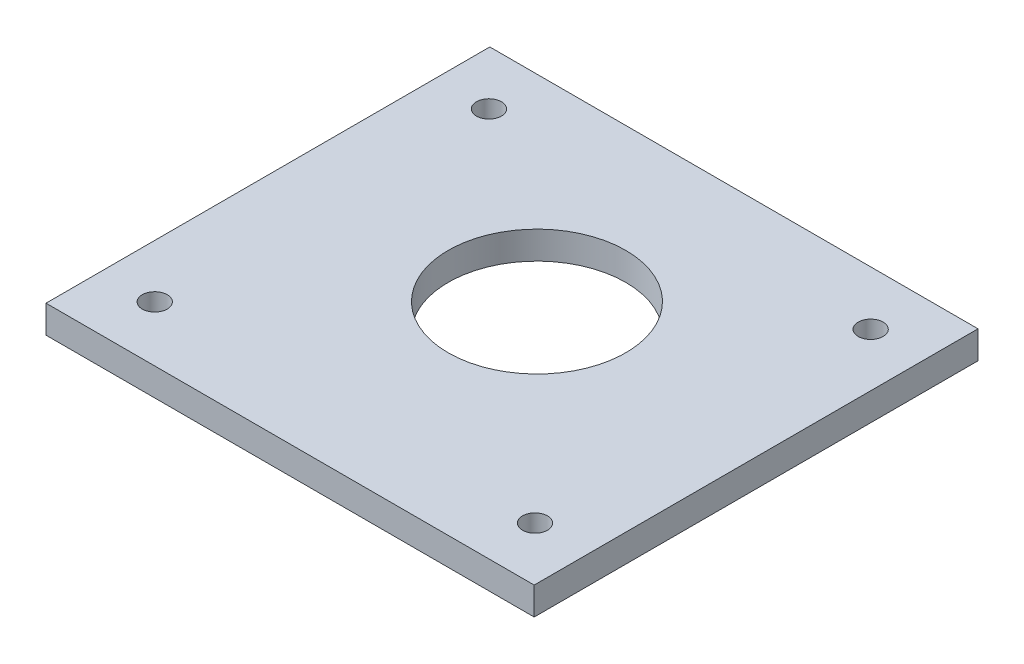
ISO-10303-21;
HEADER;
FILE_DESCRIPTION(('STEP AP214'),'2;1');
FILE_NAME('part.step','',(''),(''),'','','');
FILE_SCHEMA(('AUTOMOTIVE_DESIGN { 1 0 10303 214 1 1 1 1 }'));
ENDSEC;
DATA;
#1=APPLICATION_CONTEXT('core data for automotive mechanical design processes');
#2=APPLICATION_PROTOCOL_DEFINITION('international standard','automotive_design',2000,#1);
#3=PRODUCT_CONTEXT('',#1,'mechanical');
#4=PRODUCT('Part','Part','',(#3));
#5=PRODUCT_RELATED_PRODUCT_CATEGORY('part','',(#4));
#6=PRODUCT_DEFINITION_FORMATION('','',#4);
#7=PRODUCT_DEFINITION_CONTEXT('part definition',#1,'design');
#8=PRODUCT_DEFINITION('design','',#6,#7);
#9=PRODUCT_DEFINITION_SHAPE('','',#8);
#10=(LENGTH_UNIT() NAMED_UNIT(*) SI_UNIT(.MILLI.,.METRE.));
#11=(NAMED_UNIT(*) PLANE_ANGLE_UNIT() SI_UNIT($,.RADIAN.));
#12=(NAMED_UNIT(*) SI_UNIT($,.STERADIAN.) SOLID_ANGLE_UNIT());
#13=UNCERTAINTY_MEASURE_WITH_UNIT(LENGTH_MEASURE(1.E-05),#10,'distance_accuracy_value','');
#14=(GEOMETRIC_REPRESENTATION_CONTEXT(3) GLOBAL_UNCERTAINTY_ASSIGNED_CONTEXT((#13)) GLOBAL_UNIT_ASSIGNED_CONTEXT((#10,
#11,#12)) REPRESENTATION_CONTEXT('',''));
#15=CARTESIAN_POINT('',(0.,0.,0.));
#16=DIRECTION('',(0.,0.,1.));
#17=DIRECTION('',(1.,0.,0.));
#18=AXIS2_PLACEMENT_3D('',#15,#16,#17);
#19=CARTESIAN_POINT('',(0.,5.,0.));
#20=DIRECTION('',(0.,1.,0.));
#21=DIRECTION('',(0.,0.,1.));
#22=AXIS2_PLACEMENT_3D('',#19,#20,#21);
#23=PLANE('',#22);
#24=CARTESIAN_POINT('',(-34.4,5.,30.));
#25=DIRECTION('',(0.,1.,0.));
#26=DIRECTION('',(0.,0.,1.));
#27=AXIS2_PLACEMENT_3D('',#24,#25,#26);
#28=CIRCLE('',#27,2.25);
#29=CARTESIAN_POINT('',(-34.4,5.,32.25));
#30=VERTEX_POINT('',#29);
#31=EDGE_CURVE('E155',#30,#30,#28,.T.);
#32=ORIENTED_EDGE('',*,*,#31,.F.);
#33=EDGE_LOOP('',(#32));
#34=FACE_BOUND('',#33,.T.);
#35=CARTESIAN_POINT('',(34.4,5.,-30.25));
#36=DIRECTION('',(0.,1.,0.));
#37=DIRECTION('',(0.,0.,1.));
#38=AXIS2_PLACEMENT_3D('',#35,#36,#37);
#39=CIRCLE('',#38,2.25);
#40=CARTESIAN_POINT('',(34.4,5.,-28.));
#41=VERTEX_POINT('',#40);
#42=EDGE_CURVE('E139',#41,#41,#39,.T.);
#43=ORIENTED_EDGE('',*,*,#42,.F.);
#44=EDGE_LOOP('',(#43));
#45=FACE_BOUND('',#44,.T.);
#46=DIRECTION('',(0.,0.,-1.));
#47=VECTOR('',#46,1.);
#48=CARTESIAN_POINT('',(44.,5.,-40.));
#49=LINE('',#48,#47);
#50=CARTESIAN_POINT('',(44.,5.,40.));
#51=VERTEX_POINT('',#50);
#52=CARTESIAN_POINT('',(44.,5.,-40.));
#53=VERTEX_POINT('',#52);
#54=EDGE_CURVE('E94',#51,#53,#49,.T.);
#55=ORIENTED_EDGE('',*,*,#54,.T.);
#56=DIRECTION('',(-1.,0.,0.));
#57=VECTOR('',#56,1.);
#58=CARTESIAN_POINT('',(-44.,5.,-40.));
#59=LINE('',#58,#57);
#60=CARTESIAN_POINT('',(-44.,5.,-40.));
#61=VERTEX_POINT('',#60);
#62=EDGE_CURVE('E89',#53,#61,#59,.T.);
#63=ORIENTED_EDGE('',*,*,#62,.T.);
#64=DIRECTION('',(0.,0.,1.));
#65=VECTOR('',#64,1.);
#66=CARTESIAN_POINT('',(-44.,5.,-40.));
#67=LINE('',#66,#65);
#68=CARTESIAN_POINT('',(-44.,5.,40.));
#69=VERTEX_POINT('',#68);
#70=EDGE_CURVE('E92',#61,#69,#67,.T.);
#71=ORIENTED_EDGE('',*,*,#70,.T.);
#72=DIRECTION('',(1.,0.,0.));
#73=VECTOR('',#72,1.);
#74=CARTESIAN_POINT('',(-44.,5.,40.));
#75=LINE('',#74,#73);
#76=EDGE_CURVE('E59',#69,#51,#75,.T.);
#77=ORIENTED_EDGE('',*,*,#76,.T.);
#78=EDGE_LOOP('',(#55,#63,#71,#77));
#79=FACE_BOUND('',#78,.T.);
#80=CARTESIAN_POINT('',(-34.4,5.,-30.25));
#81=DIRECTION('',(0.,1.,0.));
#82=DIRECTION('',(0.,0.,1.));
#83=AXIS2_PLACEMENT_3D('',#80,#81,#82);
#84=CIRCLE('',#83,2.25);
#85=CARTESIAN_POINT('',(-34.4,5.,-28.));
#86=VERTEX_POINT('',#85);
#87=EDGE_CURVE('E115',#86,#86,#84,.T.);
#88=ORIENTED_EDGE('',*,*,#87,.F.);
#89=EDGE_LOOP('',(#88));
#90=FACE_BOUND('',#89,.T.);
#91=CARTESIAN_POINT('',(34.4,5.,30.25));
#92=DIRECTION('',(0.,1.,0.));
#93=DIRECTION('',(0.,0.,1.));
#94=AXIS2_PLACEMENT_3D('',#91,#92,#93);
#95=CIRCLE('',#94,2.25);
#96=CARTESIAN_POINT('',(34.4,5.,32.5));
#97=VERTEX_POINT('',#96);
#98=EDGE_CURVE('E147',#97,#97,#95,.T.);
#99=ORIENTED_EDGE('',*,*,#98,.F.);
#100=EDGE_LOOP('',(#99));
#101=FACE_BOUND('',#100,.T.);
#102=CARTESIAN_POINT('',(0.,5.,-4.5));
#103=DIRECTION('',(0.,1.,0.));
#104=DIRECTION('',(0.,0.,1.));
#105=AXIS2_PLACEMENT_3D('',#102,#103,#104);
#106=CIRCLE('',#105,16.);
#107=CARTESIAN_POINT('',(0.,5.,11.5));
#108=VERTEX_POINT('',#107);
#109=EDGE_CURVE('E163',#108,#108,#106,.T.);
#110=ORIENTED_EDGE('',*,*,#109,.F.);
#111=EDGE_LOOP('',(#110));
#112=FACE_BOUND('',#111,.T.);
#113=ADVANCED_FACE('F41',(#34,#45,#79,#90,#101,#112),#23,.T.);
#114=CARTESIAN_POINT('',(0.,0.,0.));
#115=DIRECTION('',(0.,1.,0.));
#116=DIRECTION('',(0.,0.,1.));
#117=AXIS2_PLACEMENT_3D('',#114,#115,#116);
#118=PLANE('',#117);
#119=DIRECTION('',(0.,0.,-1.));
#120=VECTOR('',#119,1.);
#121=CARTESIAN_POINT('',(44.,0.,-40.));
#122=LINE('',#121,#120);
#123=CARTESIAN_POINT('',(44.,0.,40.));
#124=VERTEX_POINT('',#123);
#125=CARTESIAN_POINT('',(44.,0.,-40.));
#126=VERTEX_POINT('',#125);
#127=EDGE_CURVE('E111',#124,#126,#122,.T.);
#128=ORIENTED_EDGE('',*,*,#127,.F.);
#129=DIRECTION('',(1.,0.,0.));
#130=VECTOR('',#129,1.);
#131=CARTESIAN_POINT('',(-44.,0.,40.));
#132=LINE('',#131,#130);
#133=CARTESIAN_POINT('',(-44.,0.,40.));
#134=VERTEX_POINT('',#133);
#135=EDGE_CURVE('E82',#134,#124,#132,.T.);
#136=ORIENTED_EDGE('',*,*,#135,.F.);
#137=DIRECTION('',(0.,0.,1.));
#138=VECTOR('',#137,1.);
#139=CARTESIAN_POINT('',(-44.,0.,-40.));
#140=LINE('',#139,#138);
#141=CARTESIAN_POINT('',(-44.,0.,-40.));
#142=VERTEX_POINT('',#141);
#143=EDGE_CURVE('E76',#142,#134,#140,.T.);
#144=ORIENTED_EDGE('',*,*,#143,.F.);
#145=DIRECTION('',(-1.,0.,0.));
#146=VECTOR('',#145,1.);
#147=CARTESIAN_POINT('',(-44.,0.,-40.));
#148=LINE('',#147,#146);
#149=EDGE_CURVE('E99',#126,#142,#148,.T.);
#150=ORIENTED_EDGE('',*,*,#149,.F.);
#151=EDGE_LOOP('',(#128,#136,#144,#150));
#152=FACE_BOUND('',#151,.T.);
#153=CARTESIAN_POINT('',(-34.4,0.,-30.25));
#154=DIRECTION('',(0.,1.,0.));
#155=DIRECTION('',(0.,0.,1.));
#156=AXIS2_PLACEMENT_3D('',#153,#154,#155);
#157=CIRCLE('',#156,2.25);
#158=CARTESIAN_POINT('',(-34.4,0.,-28.));
#159=VERTEX_POINT('',#158);
#160=EDGE_CURVE('E135',#159,#159,#157,.T.);
#161=ORIENTED_EDGE('',*,*,#160,.T.);
#162=EDGE_LOOP('',(#161));
#163=FACE_BOUND('',#162,.T.);
#164=CARTESIAN_POINT('',(34.4,0.,-30.25));
#165=DIRECTION('',(0.,1.,0.));
#166=DIRECTION('',(0.,0.,1.));
#167=AXIS2_PLACEMENT_3D('',#164,#165,#166);
#168=CIRCLE('',#167,2.25);
#169=CARTESIAN_POINT('',(34.4,0.,-28.));
#170=VERTEX_POINT('',#169);
#171=EDGE_CURVE('E143',#170,#170,#168,.T.);
#172=ORIENTED_EDGE('',*,*,#171,.T.);
#173=EDGE_LOOP('',(#172));
#174=FACE_BOUND('',#173,.T.);
#175=CARTESIAN_POINT('',(34.4,0.,30.25));
#176=DIRECTION('',(0.,1.,0.));
#177=DIRECTION('',(0.,0.,1.));
#178=AXIS2_PLACEMENT_3D('',#175,#176,#177);
#179=CIRCLE('',#178,2.25);
#180=CARTESIAN_POINT('',(34.4,0.,32.5));
#181=VERTEX_POINT('',#180);
#182=EDGE_CURVE('E151',#181,#181,#179,.T.);
#183=ORIENTED_EDGE('',*,*,#182,.T.);
#184=EDGE_LOOP('',(#183));
#185=FACE_BOUND('',#184,.T.);
#186=CARTESIAN_POINT('',(-34.4,0.,30.));
#187=DIRECTION('',(0.,1.,0.));
#188=DIRECTION('',(0.,0.,1.));
#189=AXIS2_PLACEMENT_3D('',#186,#187,#188);
#190=CIRCLE('',#189,2.25);
#191=CARTESIAN_POINT('',(-34.4,0.,32.25));
#192=VERTEX_POINT('',#191);
#193=EDGE_CURVE('E159',#192,#192,#190,.T.);
#194=ORIENTED_EDGE('',*,*,#193,.T.);
#195=EDGE_LOOP('',(#194));
#196=FACE_BOUND('',#195,.T.);
#197=CARTESIAN_POINT('',(0.,0.,-4.5));
#198=DIRECTION('',(0.,1.,0.));
#199=DIRECTION('',(0.,0.,1.));
#200=AXIS2_PLACEMENT_3D('',#197,#198,#199);
#201=CIRCLE('',#200,16.);
#202=CARTESIAN_POINT('',(0.,0.,11.5));
#203=VERTEX_POINT('',#202);
#204=EDGE_CURVE('E167',#203,#203,#201,.T.);
#205=ORIENTED_EDGE('',*,*,#204,.T.);
#206=EDGE_LOOP('',(#205));
#207=FACE_BOUND('',#206,.T.);
#208=ADVANCED_FACE('F129',(#152,#163,#174,#185,#196,#207),#118,.F.);
#209=CARTESIAN_POINT('',(44.,5.,-40.));
#210=DIRECTION('',(-1.,0.,0.));
#211=DIRECTION('',(0.,0.,1.));
#212=AXIS2_PLACEMENT_3D('',#209,#210,#211);
#213=PLANE('',#212);
#214=ORIENTED_EDGE('',*,*,#127,.T.);
#215=DIRECTION('',(0.,-1.,0.));
#216=VECTOR('',#215,1.);
#217=CARTESIAN_POINT('',(44.,5.,-40.));
#218=LINE('',#217,#216);
#219=EDGE_CURVE('E11',#53,#126,#218,.T.);
#220=ORIENTED_EDGE('',*,*,#219,.F.);
#221=ORIENTED_EDGE('',*,*,#54,.F.);
#222=DIRECTION('',(0.,-1.,0.));
#223=VECTOR('',#222,1.);
#224=CARTESIAN_POINT('',(44.,5.,40.));
#225=LINE('',#224,#223);
#226=EDGE_CURVE('E107',#51,#124,#225,.T.);
#227=ORIENTED_EDGE('',*,*,#226,.T.);
#228=EDGE_LOOP('',(#214,#220,#221,#227));
#229=FACE_BOUND('',#228,.T.);
#230=ADVANCED_FACE('F43',(#229),#213,.F.);
#231=CARTESIAN_POINT('',(-44.,5.,-40.));
#232=DIRECTION('',(0.,0.,1.));
#233=DIRECTION('',(1.,0.,0.));
#234=AXIS2_PLACEMENT_3D('',#231,#232,#233);
#235=PLANE('',#234);
#236=ORIENTED_EDGE('',*,*,#149,.T.);
#237=DIRECTION('',(0.,-1.,0.));
#238=VECTOR('',#237,1.);
#239=CARTESIAN_POINT('',(-44.,5.,-40.));
#240=LINE('',#239,#238);
#241=EDGE_CURVE('E51',#61,#142,#240,.T.);
#242=ORIENTED_EDGE('',*,*,#241,.F.);
#243=ORIENTED_EDGE('',*,*,#62,.F.);
#244=ORIENTED_EDGE('',*,*,#219,.T.);
#245=EDGE_LOOP('',(#236,#242,#243,#244));
#246=FACE_BOUND('',#245,.T.);
#247=ADVANCED_FACE('F98',(#246),#235,.F.);
#248=CARTESIAN_POINT('',(-44.,5.,-40.));
#249=DIRECTION('',(1.,0.,0.));
#250=DIRECTION('',(0.,0.,-1.));
#251=AXIS2_PLACEMENT_3D('',#248,#249,#250);
#252=PLANE('',#251);
#253=ORIENTED_EDGE('',*,*,#143,.T.);
#254=DIRECTION('',(0.,-1.,0.));
#255=VECTOR('',#254,1.);
#256=CARTESIAN_POINT('',(-44.,5.,40.));
#257=LINE('',#256,#255);
#258=EDGE_CURVE('E101',#69,#134,#257,.T.);
#259=ORIENTED_EDGE('',*,*,#258,.F.);
#260=ORIENTED_EDGE('',*,*,#70,.F.);
#261=ORIENTED_EDGE('',*,*,#241,.T.);
#262=EDGE_LOOP('',(#253,#259,#260,#261));
#263=FACE_BOUND('',#262,.T.);
#264=ADVANCED_FACE('F102',(#263),#252,.F.);
#265=CARTESIAN_POINT('',(-44.,5.,40.));
#266=DIRECTION('',(0.,0.,-1.));
#267=DIRECTION('',(-1.,0.,0.));
#268=AXIS2_PLACEMENT_3D('',#265,#266,#267);
#269=PLANE('',#268);
#270=ORIENTED_EDGE('',*,*,#135,.T.);
#271=ORIENTED_EDGE('',*,*,#226,.F.);
#272=ORIENTED_EDGE('',*,*,#76,.F.);
#273=ORIENTED_EDGE('',*,*,#258,.T.);
#274=EDGE_LOOP('',(#270,#271,#272,#273));
#275=FACE_BOUND('',#274,.T.);
#276=ADVANCED_FACE('F126',(#275),#269,.F.);
#277=CARTESIAN_POINT('',(-34.4,5.,-30.25));
#278=DIRECTION('',(0.,-1.,0.));
#279=DIRECTION('',(0.,0.,-1.));
#280=AXIS2_PLACEMENT_3D('',#277,#278,#279);
#281=CYLINDRICAL_SURFACE('',#280,2.25);
#282=ORIENTED_EDGE('',*,*,#87,.T.);
#283=EDGE_LOOP('',(#282));
#284=FACE_BOUND('',#283,.T.);
#285=ORIENTED_EDGE('',*,*,#160,.F.);
#286=EDGE_LOOP('',(#285));
#287=FACE_BOUND('',#286,.T.);
#288=ADVANCED_FACE('F189',(#284,#287),#281,.F.);
#289=CARTESIAN_POINT('',(34.4,5.,-30.25));
#290=DIRECTION('',(0.,-1.,0.));
#291=DIRECTION('',(0.,0.,-1.));
#292=AXIS2_PLACEMENT_3D('',#289,#290,#291);
#293=CYLINDRICAL_SURFACE('',#292,2.25);
#294=ORIENTED_EDGE('',*,*,#42,.T.);
#295=EDGE_LOOP('',(#294));
#296=FACE_BOUND('',#295,.T.);
#297=ORIENTED_EDGE('',*,*,#171,.F.);
#298=EDGE_LOOP('',(#297));
#299=FACE_BOUND('',#298,.T.);
#300=ADVANCED_FACE('F243',(#296,#299),#293,.F.);
#301=CARTESIAN_POINT('',(34.4,5.,30.25));
#302=DIRECTION('',(0.,-1.,0.));
#303=DIRECTION('',(0.,0.,-1.));
#304=AXIS2_PLACEMENT_3D('',#301,#302,#303);
#305=CYLINDRICAL_SURFACE('',#304,2.25);
#306=ORIENTED_EDGE('',*,*,#98,.T.);
#307=EDGE_LOOP('',(#306));
#308=FACE_BOUND('',#307,.T.);
#309=ORIENTED_EDGE('',*,*,#182,.F.);
#310=EDGE_LOOP('',(#309));
#311=FACE_BOUND('',#310,.T.);
#312=ADVANCED_FACE('F252',(#308,#311),#305,.F.);
#313=CARTESIAN_POINT('',(-34.4,5.,30.));
#314=DIRECTION('',(0.,-1.,0.));
#315=DIRECTION('',(0.,0.,-1.));
#316=AXIS2_PLACEMENT_3D('',#313,#314,#315);
#317=CYLINDRICAL_SURFACE('',#316,2.25);
#318=ORIENTED_EDGE('',*,*,#31,.T.);
#319=EDGE_LOOP('',(#318));
#320=FACE_BOUND('',#319,.T.);
#321=ORIENTED_EDGE('',*,*,#193,.F.);
#322=EDGE_LOOP('',(#321));
#323=FACE_BOUND('',#322,.T.);
#324=ADVANCED_FACE('F261',(#320,#323),#317,.F.);
#325=CARTESIAN_POINT('',(0.,5.,-4.5));
#326=DIRECTION('',(0.,-1.,0.));
#327=DIRECTION('',(0.,0.,-1.));
#328=AXIS2_PLACEMENT_3D('',#325,#326,#327);
#329=CYLINDRICAL_SURFACE('',#328,16.);
#330=ORIENTED_EDGE('',*,*,#109,.T.);
#331=EDGE_LOOP('',(#330));
#332=FACE_BOUND('',#331,.T.);
#333=ORIENTED_EDGE('',*,*,#204,.F.);
#334=EDGE_LOOP('',(#333));
#335=FACE_BOUND('',#334,.T.);
#336=ADVANCED_FACE('F176',(#332,#335),#329,.F.);
#337=CLOSED_SHELL('',(#113,#208,#230,#247,#264,#276,#288,#300,#312,#324,#336));
#338=MANIFOLD_SOLID_BREP('B2',#337);
#339=ADVANCED_BREP_SHAPE_REPRESENTATION('',(#18,#338),#14);
#340=SHAPE_DEFINITION_REPRESENTATION(#9,#339);
ENDSEC;
END-ISO-10303-21;
